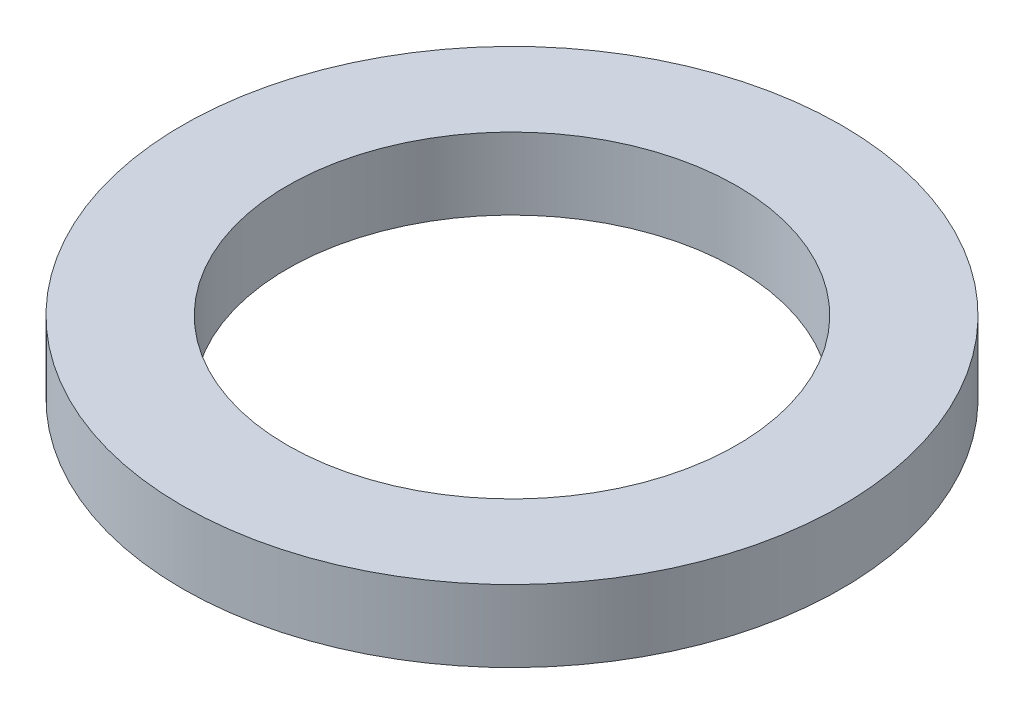
ISO-10303-21;
HEADER;
FILE_DESCRIPTION(('STEP AP214'),'2;1');
FILE_NAME('part.step','',(''),(''),'','','');
FILE_SCHEMA(('AUTOMOTIVE_DESIGN { 1 0 10303 214 1 1 1 1 }'));
ENDSEC;
DATA;
#1=APPLICATION_CONTEXT('core data for automotive mechanical design processes');
#2=APPLICATION_PROTOCOL_DEFINITION('international standard','automotive_design',2000,#1);
#3=PRODUCT_CONTEXT('',#1,'mechanical');
#4=PRODUCT('Part','Part','',(#3));
#5=PRODUCT_RELATED_PRODUCT_CATEGORY('part','',(#4));
#6=PRODUCT_DEFINITION_FORMATION('','',#4);
#7=PRODUCT_DEFINITION_CONTEXT('part definition',#1,'design');
#8=PRODUCT_DEFINITION('design','',#6,#7);
#9=PRODUCT_DEFINITION_SHAPE('','',#8);
#10=(LENGTH_UNIT() NAMED_UNIT(*) SI_UNIT(.MILLI.,.METRE.));
#11=(NAMED_UNIT(*) PLANE_ANGLE_UNIT() SI_UNIT($,.RADIAN.));
#12=(NAMED_UNIT(*) SI_UNIT($,.STERADIAN.) SOLID_ANGLE_UNIT());
#13=UNCERTAINTY_MEASURE_WITH_UNIT(LENGTH_MEASURE(1.E-05),#10,'distance_accuracy_value','');
#14=(GEOMETRIC_REPRESENTATION_CONTEXT(3) GLOBAL_UNCERTAINTY_ASSIGNED_CONTEXT((#13)) GLOBAL_UNIT_ASSIGNED_CONTEXT((#10,
#11,#12)) REPRESENTATION_CONTEXT('',''));
#15=CARTESIAN_POINT('',(0.,0.,0.));
#16=DIRECTION('',(0.,0.,1.));
#17=DIRECTION('',(1.,0.,0.));
#18=AXIS2_PLACEMENT_3D('',#15,#16,#17);
#19=CARTESIAN_POINT('',(0.,12.,0.));
#20=DIRECTION('',(0.,-1.,0.));
#21=DIRECTION('',(0.,0.,-1.));
#22=AXIS2_PLACEMENT_3D('',#19,#20,#21);
#23=CYLINDRICAL_SURFACE('',#22,55.);
#24=CARTESIAN_POINT('',(0.,12.,0.));
#25=DIRECTION('',(0.,1.,0.));
#26=DIRECTION('',(0.,0.,1.));
#27=AXIS2_PLACEMENT_3D('',#24,#25,#26);
#28=CIRCLE('',#27,55.);
#29=CARTESIAN_POINT('',(0.,12.,55.));
#30=VERTEX_POINT('',#29);
#31=EDGE_CURVE('E10',#30,#30,#28,.T.);
#32=ORIENTED_EDGE('',*,*,#31,.F.);
#33=EDGE_LOOP('',(#32));
#34=FACE_BOUND('',#33,.T.);
#35=CARTESIAN_POINT('',(0.,0.,0.));
#36=DIRECTION('',(0.,1.,0.));
#37=DIRECTION('',(0.,0.,1.));
#38=AXIS2_PLACEMENT_3D('',#35,#36,#37);
#39=CIRCLE('',#38,55.);
#40=CARTESIAN_POINT('',(0.,0.,55.));
#41=VERTEX_POINT('',#40);
#42=EDGE_CURVE('E37',#41,#41,#39,.T.);
#43=ORIENTED_EDGE('',*,*,#42,.T.);
#44=EDGE_LOOP('',(#43));
#45=FACE_BOUND('',#44,.T.);
#46=ADVANCED_FACE('F40',(#34,#45),#23,.T.);
#47=CARTESIAN_POINT('',(0.,12.,0.));
#48=DIRECTION('',(0.,1.,0.));
#49=DIRECTION('',(0.,0.,1.));
#50=AXIS2_PLACEMENT_3D('',#47,#48,#49);
#51=PLANE('',#50);
#52=CARTESIAN_POINT('',(0.,12.,0.));
#53=DIRECTION('',(0.,1.,0.));
#54=DIRECTION('',(0.,0.,1.));
#55=AXIS2_PLACEMENT_3D('',#52,#53,#54);
#56=CIRCLE('',#55,37.5);
#57=CARTESIAN_POINT('',(0.,12.,37.5));
#58=VERTEX_POINT('',#57);
#59=EDGE_CURVE('E50',#58,#58,#56,.T.);
#60=ORIENTED_EDGE('',*,*,#59,.F.);
#61=EDGE_LOOP('',(#60));
#62=FACE_BOUND('',#61,.T.);
#63=ORIENTED_EDGE('',*,*,#31,.T.);
#64=EDGE_LOOP('',(#63));
#65=FACE_BOUND('',#64,.T.);
#66=ADVANCED_FACE('F59',(#62,#65),#51,.T.);
#67=CARTESIAN_POINT('',(0.,0.,0.));
#68=DIRECTION('',(0.,1.,0.));
#69=DIRECTION('',(0.,0.,1.));
#70=AXIS2_PLACEMENT_3D('',#67,#68,#69);
#71=PLANE('',#70);
#72=CARTESIAN_POINT('',(0.,0.,0.));
#73=DIRECTION('',(0.,1.,0.));
#74=DIRECTION('',(0.,0.,1.));
#75=AXIS2_PLACEMENT_3D('',#72,#73,#74);
#76=CIRCLE('',#75,37.5);
#77=CARTESIAN_POINT('',(0.,0.,37.5));
#78=VERTEX_POINT('',#77);
#79=EDGE_CURVE('E47',#78,#78,#76,.T.);
#80=ORIENTED_EDGE('',*,*,#79,.T.);
#81=EDGE_LOOP('',(#80));
#82=FACE_BOUND('',#81,.T.);
#83=ORIENTED_EDGE('',*,*,#42,.F.);
#84=EDGE_LOOP('',(#83));
#85=FACE_BOUND('',#84,.T.);
#86=ADVANCED_FACE('F58',(#82,#85),#71,.F.);
#87=CARTESIAN_POINT('',(0.,12.,0.));
#88=DIRECTION('',(0.,-1.,0.));
#89=DIRECTION('',(0.,0.,-1.));
#90=AXIS2_PLACEMENT_3D('',#87,#88,#89);
#91=CYLINDRICAL_SURFACE('',#90,37.5);
#92=ORIENTED_EDGE('',*,*,#59,.T.);
#93=EDGE_LOOP('',(#92));
#94=FACE_BOUND('',#93,.T.);
#95=ORIENTED_EDGE('',*,*,#79,.F.);
#96=EDGE_LOOP('',(#95));
#97=FACE_BOUND('',#96,.T.);
#98=ADVANCED_FACE('F54',(#94,#97),#91,.F.);
#99=CLOSED_SHELL('',(#46,#66,#86,#98));
#100=MANIFOLD_SOLID_BREP('B2',#99);
#101=ADVANCED_BREP_SHAPE_REPRESENTATION('',(#18,#100),#14);
#102=SHAPE_DEFINITION_REPRESENTATION(#9,#101);
ENDSEC;
END-ISO-10303-21;
